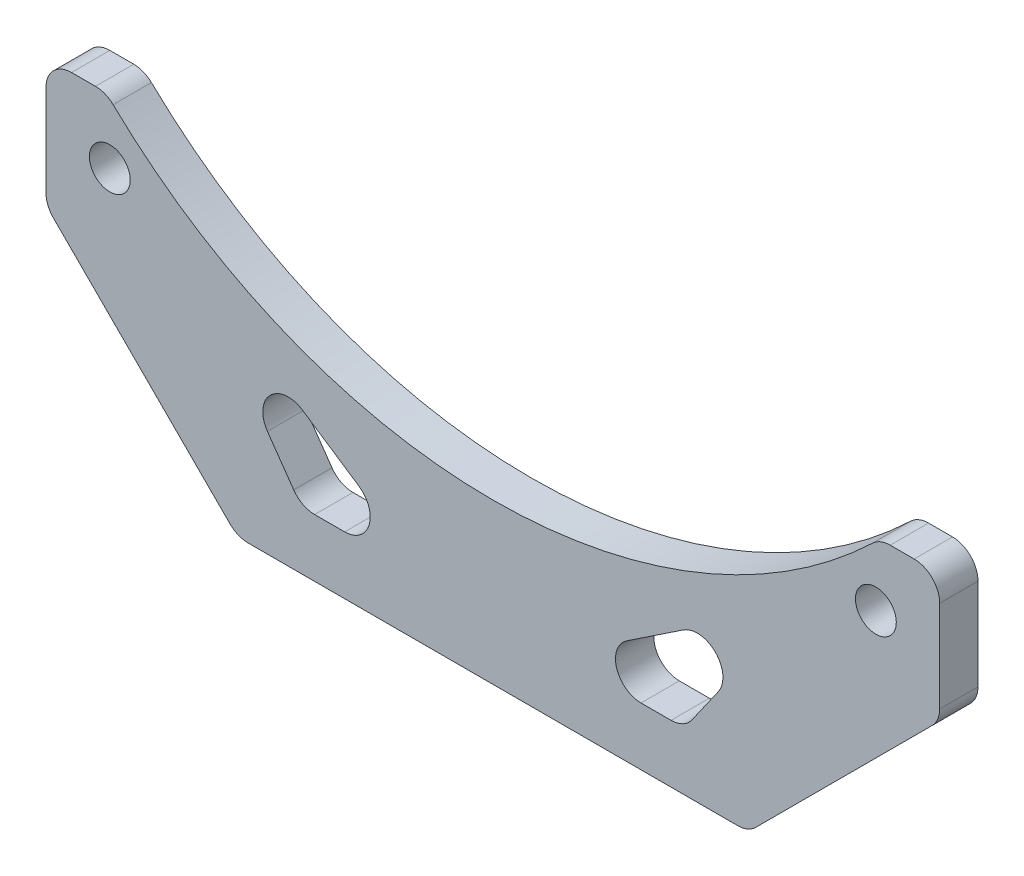
ISO-10303-21;
HEADER;
FILE_DESCRIPTION(('STEP AP214'),'2;1');
FILE_NAME('part.step','',(''),(''),'','','');
FILE_SCHEMA(('AUTOMOTIVE_DESIGN { 1 0 10303 214 1 1 1 1 }'));
ENDSEC;
DATA;
#1=APPLICATION_CONTEXT('core data for automotive mechanical design processes');
#2=APPLICATION_PROTOCOL_DEFINITION('international standard','automotive_design',2000,#1);
#3=PRODUCT_CONTEXT('',#1,'mechanical');
#4=PRODUCT('Part','Part','',(#3));
#5=PRODUCT_RELATED_PRODUCT_CATEGORY('part','',(#4));
#6=PRODUCT_DEFINITION_FORMATION('','',#4);
#7=PRODUCT_DEFINITION_CONTEXT('part definition',#1,'design');
#8=PRODUCT_DEFINITION('design','',#6,#7);
#9=PRODUCT_DEFINITION_SHAPE('','',#8);
#10=(LENGTH_UNIT() NAMED_UNIT(*) SI_UNIT(.MILLI.,.METRE.));
#11=(NAMED_UNIT(*) PLANE_ANGLE_UNIT() SI_UNIT($,.RADIAN.));
#12=(NAMED_UNIT(*) SI_UNIT($,.STERADIAN.) SOLID_ANGLE_UNIT());
#13=UNCERTAINTY_MEASURE_WITH_UNIT(LENGTH_MEASURE(1.E-05),#10,'distance_accuracy_value','');
#14=(GEOMETRIC_REPRESENTATION_CONTEXT(3) GLOBAL_UNCERTAINTY_ASSIGNED_CONTEXT((#13)) GLOBAL_UNIT_ASSIGNED_CONTEXT((#10,
#11,#12)) REPRESENTATION_CONTEXT('',''));
#15=CARTESIAN_POINT('',(0.,0.,0.));
#16=DIRECTION('',(0.,0.,1.));
#17=DIRECTION('',(1.,0.,0.));
#18=AXIS2_PLACEMENT_3D('',#15,#16,#17);
#19=CARTESIAN_POINT('',(30.,35.5000000000022,3.));
#20=DIRECTION('',(0.,0.,1.));
#21=DIRECTION('',(1.,0.,0.));
#22=AXIS2_PLACEMENT_3D('',#19,#20,#21);
#23=PLANE('',#22);
#24=DIRECTION('',(-1.,0.,0.));
#25=VECTOR('',#24,1.);
#26=CARTESIAN_POINT('',(45.0249792013122,5.,3.));
#27=LINE('',#26,#25);
#28=CARTESIAN_POINT('',(63.,5.,3.));
#29=VERTEX_POINT('',#28);
#30=CARTESIAN_POINT('',(61.1247489949716,5.,3.));
#31=VERTEX_POINT('',#30);
#32=EDGE_CURVE('E282',#29,#31,#27,.T.);
#33=ORIENTED_EDGE('',*,*,#32,.T.);
#34=CARTESIAN_POINT('',(61.1247489949716,3.,3.));
#35=DIRECTION('',(0.,0.,1.));
#36=DIRECTION('',(1.,0.,0.));
#37=AXIS2_PLACEMENT_3D('',#34,#35,#36);
#38=CIRCLE('',#37,2.);
#39=CARTESIAN_POINT('',(59.7414268174173,4.44444444444442,3.));
#40=VERTEX_POINT('',#39);
#41=EDGE_CURVE('E359',#31,#40,#38,.T.);
#42=ORIENTED_EDGE('',*,*,#41,.T.);
#43=CARTESIAN_POINT('',(29.9999999999983,35.5000000000004,3.));
#44=DIRECTION('',(0.,0.,1.));
#45=DIRECTION('',(1.,0.,0.));
#46=AXIS2_PLACEMENT_3D('',#43,#44,#45);
#47=CIRCLE('',#46,43.0000000000014);
#48=CARTESIAN_POINT('',(0.258573182579214,4.44444444444443,3.));
#49=VERTEX_POINT('',#48);
#50=EDGE_CURVE('E254',#49,#40,#47,.T.);
#51=ORIENTED_EDGE('',*,*,#50,.F.);
#52=CARTESIAN_POINT('',(-1.12474899497512,3.00000000000001,3.));
#53=DIRECTION('',(0.,0.,1.));
#54=DIRECTION('',(1.,0.,0.));
#55=AXIS2_PLACEMENT_3D('',#52,#53,#54);
#56=CIRCLE('',#55,2.);
#57=CARTESIAN_POINT('',(-1.12474899497512,5.,3.));
#58=VERTEX_POINT('',#57);
#59=EDGE_CURVE('E347',#49,#58,#56,.T.);
#60=ORIENTED_EDGE('',*,*,#59,.T.);
#61=DIRECTION('',(-1.,0.,0.));
#62=VECTOR('',#61,1.);
#63=CARTESIAN_POINT('',(-5.,5.,3.));
#64=LINE('',#63,#62);
#65=CARTESIAN_POINT('',(-3.,5.,3.));
#66=VERTEX_POINT('',#65);
#67=EDGE_CURVE('E285',#58,#66,#64,.T.);
#68=ORIENTED_EDGE('',*,*,#67,.T.);
#69=CARTESIAN_POINT('',(-3.,3.,3.));
#70=DIRECTION('',(0.,0.,1.));
#71=DIRECTION('',(1.,0.,0.));
#72=AXIS2_PLACEMENT_3D('',#69,#70,#71);
#73=CIRCLE('',#72,2.);
#74=CARTESIAN_POINT('',(-5.,3.,3.));
#75=VERTEX_POINT('',#74);
#76=EDGE_CURVE('E345',#66,#75,#73,.T.);
#77=ORIENTED_EDGE('',*,*,#76,.T.);
#78=DIRECTION('',(0.,-1.,0.));
#79=VECTOR('',#78,1.);
#80=CARTESIAN_POINT('',(-5.,5.,3.));
#81=LINE('',#80,#79);
#82=CARTESIAN_POINT('',(-5.,-4.17157287525381,3.));
#83=VERTEX_POINT('',#82);
#84=EDGE_CURVE('E288',#75,#83,#81,.T.);
#85=ORIENTED_EDGE('',*,*,#84,.T.);
#86=CARTESIAN_POINT('',(-3.,-4.17157287525381,3.));
#87=DIRECTION('',(0.,0.,1.));
#88=DIRECTION('',(1.,0.,0.));
#89=AXIS2_PLACEMENT_3D('',#86,#87,#88);
#90=CIRCLE('',#89,2.);
#91=CARTESIAN_POINT('',(-4.4142135623731,-5.58578643762691,3.));
#92=VERTEX_POINT('',#91);
#93=EDGE_CURVE('E349',#83,#92,#90,.T.);
#94=ORIENTED_EDGE('',*,*,#93,.T.);
#95=DIRECTION('',(0.707106781186547,-0.707106781186548,0.));
#96=VECTOR('',#95,1.);
#97=CARTESIAN_POINT('',(-5.,-5.,3.));
#98=LINE('',#97,#96);
#99=CARTESIAN_POINT('',(9.41421356237308,-19.4142135623731,3.));
#100=VERTEX_POINT('',#99);
#101=EDGE_CURVE('E291',#92,#100,#98,.T.);
#102=ORIENTED_EDGE('',*,*,#101,.T.);
#103=CARTESIAN_POINT('',(10.8284271247462,-18.,3.));
#104=DIRECTION('',(0.,0.,1.));
#105=DIRECTION('',(1.,0.,0.));
#106=AXIS2_PLACEMENT_3D('',#103,#104,#105);
#107=CIRCLE('',#106,2.);
#108=CARTESIAN_POINT('',(10.8284271247462,-20.,3.));
#109=VERTEX_POINT('',#108);
#110=EDGE_CURVE('E351',#100,#109,#107,.T.);
#111=ORIENTED_EDGE('',*,*,#110,.T.);
#112=DIRECTION('',(1.,0.,0.));
#113=VECTOR('',#112,1.);
#114=CARTESIAN_POINT('',(9.99999999999999,-20.,3.));
#115=LINE('',#114,#113);
#116=CARTESIAN_POINT('',(49.1715728752538,-20.,3.));
#117=VERTEX_POINT('',#116);
#118=EDGE_CURVE('E294',#109,#117,#115,.T.);
#119=ORIENTED_EDGE('',*,*,#118,.T.);
#120=CARTESIAN_POINT('',(49.1715728752538,-18.,3.));
#121=DIRECTION('',(0.,0.,1.));
#122=DIRECTION('',(1.,0.,0.));
#123=AXIS2_PLACEMENT_3D('',#120,#121,#122);
#124=CIRCLE('',#123,2.);
#125=CARTESIAN_POINT('',(50.5857864376269,-19.4142135623731,3.));
#126=VERTEX_POINT('',#125);
#127=EDGE_CURVE('E353',#117,#126,#124,.T.);
#128=ORIENTED_EDGE('',*,*,#127,.T.);
#129=DIRECTION('',(0.707106781186547,0.707106781186547,0.));
#130=VECTOR('',#129,1.);
#131=CARTESIAN_POINT('',(50.,-20.,3.));
#132=LINE('',#131,#130);
#133=CARTESIAN_POINT('',(64.4142135623731,-5.58578643762691,3.));
#134=VERTEX_POINT('',#133);
#135=EDGE_CURVE('E275',#126,#134,#132,.T.);
#136=ORIENTED_EDGE('',*,*,#135,.T.);
#137=CARTESIAN_POINT('',(63.,-4.17157287525381,3.));
#138=DIRECTION('',(0.,0.,1.));
#139=DIRECTION('',(1.,0.,0.));
#140=AXIS2_PLACEMENT_3D('',#137,#138,#139);
#141=CIRCLE('',#140,2.);
#142=CARTESIAN_POINT('',(65.,-4.17157287525381,3.));
#143=VERTEX_POINT('',#142);
#144=EDGE_CURVE('E355',#134,#143,#141,.T.);
#145=ORIENTED_EDGE('',*,*,#144,.T.);
#146=DIRECTION('',(0.,1.,0.));
#147=VECTOR('',#146,1.);
#148=CARTESIAN_POINT('',(65.,5.,3.));
#149=LINE('',#148,#147);
#150=CARTESIAN_POINT('',(65.,3.,3.));
#151=VERTEX_POINT('',#150);
#152=EDGE_CURVE('E278',#143,#151,#149,.T.);
#153=ORIENTED_EDGE('',*,*,#152,.T.);
#154=CARTESIAN_POINT('',(63.,3.,3.));
#155=DIRECTION('',(0.,0.,1.));
#156=DIRECTION('',(1.,0.,0.));
#157=AXIS2_PLACEMENT_3D('',#154,#155,#156);
#158=CIRCLE('',#157,2.);
#159=EDGE_CURVE('E357',#151,#29,#158,.T.);
#160=ORIENTED_EDGE('',*,*,#159,.T.);
#161=EDGE_LOOP('',(#33,#42,#51,#60,#68,#77,#85,#94,#102,#111,#119,#128,#136,#145,#153,#160));
#162=FACE_BOUND('',#161,.T.);
#163=DIRECTION('',(-0.573576436351044,0.819152044288993,0.));
#164=VECTOR('',#163,1.);
#165=CARTESIAN_POINT('',(15.,-15.464816241512,3.));
#166=LINE('',#165,#164);
#167=CARTESIAN_POINT('',(14.4028300125255,-14.6119691142141,3.));
#168=VERTEX_POINT('',#167);
#169=CARTESIAN_POINT('',(12.3425347261483,-11.6695625076743,3.));
#170=VERTEX_POINT('',#169);
#171=EDGE_CURVE('E268',#168,#170,#166,.T.);
#172=ORIENTED_EDGE('',*,*,#171,.T.);
#173=CARTESIAN_POINT('',(13.9808388147263,-10.5224096349722,3.));
#174=DIRECTION('',(0.,0.,1.));
#175=DIRECTION('',(1.,0.,0.));
#176=AXIS2_PLACEMENT_3D('',#173,#174,#175);
#177=CIRCLE('',#176,2.);
#178=CARTESIAN_POINT('',(15.0902392071767,-8.85830904629649,3.));
#179=VERTEX_POINT('',#178);
#180=EDGE_CURVE('E417',#170,#179,#177,.F.);
#181=ORIENTED_EDGE('',*,*,#180,.T.);
#182=DIRECTION('',(0.832050294337844,-0.554700196225229,0.));
#183=VECTOR('',#182,1.);
#184=CARTESIAN_POINT('',(6.2451345610044,-2.96157261551494,3.));
#185=LINE('',#184,#183);
#186=CARTESIAN_POINT('',(19.5038491169865,-11.8007156528363,3.));
#187=VERTEX_POINT('',#186);
#188=EDGE_CURVE('E447',#179,#187,#185,.T.);
#189=ORIENTED_EDGE('',*,*,#188,.T.);
#190=CARTESIAN_POINT('',(18.394448724536,-13.464816241512,3.));
#191=DIRECTION('',(0.,0.,1.));
#192=DIRECTION('',(1.,0.,0.));
#193=AXIS2_PLACEMENT_3D('',#190,#191,#192);
#194=CIRCLE('',#193,2.);
#195=CARTESIAN_POINT('',(18.394448724536,-15.464816241512,3.));
#196=VERTEX_POINT('',#195);
#197=EDGE_CURVE('E11',#187,#196,#194,.F.);
#198=ORIENTED_EDGE('',*,*,#197,.T.);
#199=DIRECTION('',(-1.,0.,0.));
#200=VECTOR('',#199,1.);
#201=CARTESIAN_POINT('',(25.,-15.464816241512,3.));
#202=LINE('',#201,#200);
#203=CARTESIAN_POINT('',(16.0411341011035,-15.464816241512,3.));
#204=VERTEX_POINT('',#203);
#205=EDGE_CURVE('E445',#196,#204,#202,.T.);
#206=ORIENTED_EDGE('',*,*,#205,.T.);
#207=CARTESIAN_POINT('',(16.0411341011035,-13.464816241512,3.));
#208=DIRECTION('',(0.,0.,1.));
#209=DIRECTION('',(1.,0.,0.));
#210=AXIS2_PLACEMENT_3D('',#207,#208,#209);
#211=CIRCLE('',#210,2.);
#212=EDGE_CURVE('E421',#204,#168,#211,.F.);
#213=ORIENTED_EDGE('',*,*,#212,.T.);
#214=EDGE_LOOP('',(#172,#181,#189,#198,#206,#213));
#215=FACE_BOUND('',#214,.T.);
#216=DIRECTION('',(0.832050294337844,0.554700196225229,0.));
#217=VECTOR('',#216,1.);
#218=CARTESIAN_POINT('',(53.7548654389956,-2.96157261551494,3.));
#219=LINE('',#218,#217);
#220=CARTESIAN_POINT('',(40.4961508830135,-11.8007156528363,3.));
#221=VERTEX_POINT('',#220);
#222=CARTESIAN_POINT('',(44.9097607928233,-8.85830904629648,3.));
#223=VERTEX_POINT('',#222);
#224=EDGE_CURVE('E257',#221,#223,#219,.T.);
#225=ORIENTED_EDGE('',*,*,#224,.T.);
#226=CARTESIAN_POINT('',(46.0191611852737,-10.5224096349722,3.));
#227=DIRECTION('',(0.,0.,1.));
#228=DIRECTION('',(1.,0.,0.));
#229=AXIS2_PLACEMENT_3D('',#226,#227,#228);
#230=CIRCLE('',#229,2.);
#231=CARTESIAN_POINT('',(47.6574652738517,-11.6695625076743,3.));
#232=VERTEX_POINT('',#231);
#233=EDGE_CURVE('E230',#223,#232,#230,.F.);
#234=ORIENTED_EDGE('',*,*,#233,.T.);
#235=DIRECTION('',(-0.573576436351044,-0.819152044288993,0.));
#236=VECTOR('',#235,1.);
#237=CARTESIAN_POINT('',(45.,-15.464816241512,3.));
#238=LINE('',#237,#236);
#239=CARTESIAN_POINT('',(45.5971699874745,-14.6119691142141,3.));
#240=VERTEX_POINT('',#239);
#241=EDGE_CURVE('E240',#232,#240,#238,.T.);
#242=ORIENTED_EDGE('',*,*,#241,.T.);
#243=CARTESIAN_POINT('',(43.9588658988965,-13.464816241512,3.));
#244=DIRECTION('',(0.,0.,1.));
#245=DIRECTION('',(1.,0.,0.));
#246=AXIS2_PLACEMENT_3D('',#243,#244,#245);
#247=CIRCLE('',#246,2.);
#248=CARTESIAN_POINT('',(43.9588658988965,-15.464816241512,3.));
#249=VERTEX_POINT('',#248);
#250=EDGE_CURVE('E413',#240,#249,#247,.F.);
#251=ORIENTED_EDGE('',*,*,#250,.T.);
#252=DIRECTION('',(-1.,0.,0.));
#253=VECTOR('',#252,1.);
#254=CARTESIAN_POINT('',(35.,-15.464816241512,3.));
#255=LINE('',#254,#253);
#256=CARTESIAN_POINT('',(41.605551275464,-15.464816241512,3.));
#257=VERTEX_POINT('',#256);
#258=EDGE_CURVE('E459',#249,#257,#255,.T.);
#259=ORIENTED_EDGE('',*,*,#258,.T.);
#260=CARTESIAN_POINT('',(41.605551275464,-13.464816241512,3.));
#261=DIRECTION('',(0.,0.,1.));
#262=DIRECTION('',(1.,0.,0.));
#263=AXIS2_PLACEMENT_3D('',#260,#261,#262);
#264=CIRCLE('',#263,2.);
#265=EDGE_CURVE('E410',#257,#221,#264,.F.);
#266=ORIENTED_EDGE('',*,*,#265,.T.);
#267=EDGE_LOOP('',(#225,#234,#242,#251,#259,#266));
#268=FACE_BOUND('',#267,.T.);
#269=CARTESIAN_POINT('',(60.,0.,3.));
#270=DIRECTION('',(0.,0.,1.));
#271=DIRECTION('',(1.,0.,0.));
#272=AXIS2_PLACEMENT_3D('',#269,#270,#271);
#273=CIRCLE('',#272,1.6);
#274=CARTESIAN_POINT('',(61.6,0.,3.));
#275=VERTEX_POINT('',#274);
#276=EDGE_CURVE('E269',#275,#275,#273,.T.);
#277=ORIENTED_EDGE('',*,*,#276,.F.);
#278=EDGE_LOOP('',(#277));
#279=FACE_BOUND('',#278,.T.);
#280=CARTESIAN_POINT('',(0.,0.,3.));
#281=DIRECTION('',(0.,0.,1.));
#282=DIRECTION('',(1.,0.,0.));
#283=AXIS2_PLACEMENT_3D('',#280,#281,#282);
#284=CIRCLE('',#283,1.6);
#285=CARTESIAN_POINT('',(1.6,0.,3.));
#286=VERTEX_POINT('',#285);
#287=EDGE_CURVE('E261',#286,#286,#284,.T.);
#288=ORIENTED_EDGE('',*,*,#287,.F.);
#289=EDGE_LOOP('',(#288));
#290=FACE_BOUND('',#289,.T.);
#291=ADVANCED_FACE('F34',(#162,#215,#268,#279,#290),#23,.T.);
#292=CARTESIAN_POINT('',(30.,35.5000000000022,0.));
#293=DIRECTION('',(0.,0.,1.));
#294=DIRECTION('',(1.,0.,0.));
#295=AXIS2_PLACEMENT_3D('',#292,#293,#294);
#296=PLANE('',#295);
#297=DIRECTION('',(-1.,0.,0.));
#298=VECTOR('',#297,1.);
#299=CARTESIAN_POINT('',(25.,-15.464816241512,0.));
#300=LINE('',#299,#298);
#301=CARTESIAN_POINT('',(18.394448724536,-15.464816241512,0.));
#302=VERTEX_POINT('',#301);
#303=CARTESIAN_POINT('',(16.0411341011035,-15.464816241512,0.));
#304=VERTEX_POINT('',#303);
#305=EDGE_CURVE('E428',#302,#304,#300,.T.);
#306=ORIENTED_EDGE('',*,*,#305,.F.);
#307=CARTESIAN_POINT('',(18.394448724536,-13.464816241512,0.));
#308=DIRECTION('',(0.,0.,1.));
#309=DIRECTION('',(1.,0.,0.));
#310=AXIS2_PLACEMENT_3D('',#307,#308,#309);
#311=CIRCLE('',#310,2.);
#312=CARTESIAN_POINT('',(19.5038491169865,-11.8007156528363,0.));
#313=VERTEX_POINT('',#312);
#314=EDGE_CURVE('E42',#302,#313,#311,.T.);
#315=ORIENTED_EDGE('',*,*,#314,.T.);
#316=DIRECTION('',(0.832050294337844,-0.554700196225229,0.));
#317=VECTOR('',#316,1.);
#318=CARTESIAN_POINT('',(6.2451345610044,-2.96157261551494,0.));
#319=LINE('',#318,#317);
#320=CARTESIAN_POINT('',(15.0902392071767,-8.85830904629649,0.));
#321=VERTEX_POINT('',#320);
#322=EDGE_CURVE('E426',#321,#313,#319,.T.);
#323=ORIENTED_EDGE('',*,*,#322,.F.);
#324=CARTESIAN_POINT('',(13.9808388147263,-10.5224096349722,0.));
#325=DIRECTION('',(0.,0.,1.));
#326=DIRECTION('',(1.,0.,0.));
#327=AXIS2_PLACEMENT_3D('',#324,#325,#326);
#328=CIRCLE('',#327,2.);
#329=CARTESIAN_POINT('',(12.3425347261483,-11.6695625076743,0.));
#330=VERTEX_POINT('',#329);
#331=EDGE_CURVE('E415',#321,#330,#328,.T.);
#332=ORIENTED_EDGE('',*,*,#331,.T.);
#333=DIRECTION('',(-0.573576436351044,0.819152044288993,0.));
#334=VECTOR('',#333,1.);
#335=CARTESIAN_POINT('',(15.,-15.464816241512,0.));
#336=LINE('',#335,#334);
#337=CARTESIAN_POINT('',(14.4028300125255,-14.6119691142141,0.));
#338=VERTEX_POINT('',#337);
#339=EDGE_CURVE('E453',#338,#330,#336,.T.);
#340=ORIENTED_EDGE('',*,*,#339,.F.);
#341=CARTESIAN_POINT('',(16.0411341011035,-13.464816241512,0.));
#342=DIRECTION('',(0.,0.,1.));
#343=DIRECTION('',(1.,0.,0.));
#344=AXIS2_PLACEMENT_3D('',#341,#342,#343);
#345=CIRCLE('',#344,2.);
#346=EDGE_CURVE('E419',#338,#304,#345,.T.);
#347=ORIENTED_EDGE('',*,*,#346,.T.);
#348=EDGE_LOOP('',(#306,#315,#323,#332,#340,#347));
#349=FACE_BOUND('',#348,.T.);
#350=DIRECTION('',(-1.,0.,0.));
#351=VECTOR('',#350,1.);
#352=CARTESIAN_POINT('',(35.,-15.464816241512,0.));
#353=LINE('',#352,#351);
#354=CARTESIAN_POINT('',(43.9588658988965,-15.464816241512,0.));
#355=VERTEX_POINT('',#354);
#356=CARTESIAN_POINT('',(41.605551275464,-15.464816241512,0.));
#357=VERTEX_POINT('',#356);
#358=EDGE_CURVE('E247',#355,#357,#353,.T.);
#359=ORIENTED_EDGE('',*,*,#358,.F.);
#360=CARTESIAN_POINT('',(43.9588658988965,-13.464816241512,0.));
#361=DIRECTION('',(0.,0.,1.));
#362=DIRECTION('',(1.,0.,0.));
#363=AXIS2_PLACEMENT_3D('',#360,#361,#362);
#364=CIRCLE('',#363,2.);
#365=CARTESIAN_POINT('',(45.5971699874745,-14.6119691142141,0.));
#366=VERTEX_POINT('',#365);
#367=EDGE_CURVE('E246',#355,#366,#364,.T.);
#368=ORIENTED_EDGE('',*,*,#367,.T.);
#369=DIRECTION('',(-0.573576436351044,-0.819152044288993,0.));
#370=VECTOR('',#369,1.);
#371=CARTESIAN_POINT('',(45.,-15.464816241512,0.));
#372=LINE('',#371,#370);
#373=CARTESIAN_POINT('',(47.6574652738517,-11.6695625076743,0.));
#374=VERTEX_POINT('',#373);
#375=EDGE_CURVE('E237',#374,#366,#372,.T.);
#376=ORIENTED_EDGE('',*,*,#375,.F.);
#377=CARTESIAN_POINT('',(46.0191611852737,-10.5224096349722,0.));
#378=DIRECTION('',(0.,0.,1.));
#379=DIRECTION('',(1.,0.,0.));
#380=AXIS2_PLACEMENT_3D('',#377,#378,#379);
#381=CIRCLE('',#380,2.);
#382=CARTESIAN_POINT('',(44.9097607928233,-8.85830904629648,0.));
#383=VERTEX_POINT('',#382);
#384=EDGE_CURVE('E220',#374,#383,#381,.T.);
#385=ORIENTED_EDGE('',*,*,#384,.T.);
#386=DIRECTION('',(0.832050294337844,0.554700196225229,0.));
#387=VECTOR('',#386,1.);
#388=CARTESIAN_POINT('',(53.7548654389956,-2.96157261551494,0.));
#389=LINE('',#388,#387);
#390=CARTESIAN_POINT('',(40.4961508830135,-11.8007156528363,0.));
#391=VERTEX_POINT('',#390);
#392=EDGE_CURVE('E251',#391,#383,#389,.T.);
#393=ORIENTED_EDGE('',*,*,#392,.F.);
#394=CARTESIAN_POINT('',(41.605551275464,-13.464816241512,0.));
#395=DIRECTION('',(0.,0.,1.));
#396=DIRECTION('',(1.,0.,0.));
#397=AXIS2_PLACEMENT_3D('',#394,#395,#396);
#398=CIRCLE('',#397,2.);
#399=EDGE_CURVE('E408',#391,#357,#398,.T.);
#400=ORIENTED_EDGE('',*,*,#399,.T.);
#401=EDGE_LOOP('',(#359,#368,#376,#385,#393,#400));
#402=FACE_BOUND('',#401,.T.);
#403=CARTESIAN_POINT('',(29.9999999999983,35.5000000000004,0.));
#404=DIRECTION('',(0.,0.,1.));
#405=DIRECTION('',(1.,0.,0.));
#406=AXIS2_PLACEMENT_3D('',#403,#404,#405);
#407=CIRCLE('',#406,43.0000000000014);
#408=CARTESIAN_POINT('',(0.258573182579214,4.44444444444443,0.));
#409=VERTEX_POINT('',#408);
#410=CARTESIAN_POINT('',(59.7414268174173,4.44444444444442,0.));
#411=VERTEX_POINT('',#410);
#412=EDGE_CURVE('E248',#409,#411,#407,.T.);
#413=ORIENTED_EDGE('',*,*,#412,.T.);
#414=CARTESIAN_POINT('',(61.1247489949716,3.,0.));
#415=DIRECTION('',(0.,0.,1.));
#416=DIRECTION('',(1.,0.,0.));
#417=AXIS2_PLACEMENT_3D('',#414,#415,#416);
#418=CIRCLE('',#417,2.);
#419=CARTESIAN_POINT('',(61.1247489949716,5.,0.));
#420=VERTEX_POINT('',#419);
#421=EDGE_CURVE('E377',#411,#420,#418,.F.);
#422=ORIENTED_EDGE('',*,*,#421,.T.);
#423=DIRECTION('',(-1.,0.,0.));
#424=VECTOR('',#423,1.);
#425=CARTESIAN_POINT('',(45.0249792013122,5.,0.));
#426=LINE('',#425,#424);
#427=CARTESIAN_POINT('',(63.,5.,0.));
#428=VERTEX_POINT('',#427);
#429=EDGE_CURVE('E302',#428,#420,#426,.T.);
#430=ORIENTED_EDGE('',*,*,#429,.F.);
#431=CARTESIAN_POINT('',(63.,3.,0.));
#432=DIRECTION('',(0.,0.,1.));
#433=DIRECTION('',(1.,0.,0.));
#434=AXIS2_PLACEMENT_3D('',#431,#432,#433);
#435=CIRCLE('',#434,2.);
#436=CARTESIAN_POINT('',(65.,3.,0.));
#437=VERTEX_POINT('',#436);
#438=EDGE_CURVE('E375',#428,#437,#435,.F.);
#439=ORIENTED_EDGE('',*,*,#438,.T.);
#440=DIRECTION('',(0.,1.,0.));
#441=VECTOR('',#440,1.);
#442=CARTESIAN_POINT('',(65.,5.,0.));
#443=LINE('',#442,#441);
#444=CARTESIAN_POINT('',(65.,-4.17157287525381,0.));
#445=VERTEX_POINT('',#444);
#446=EDGE_CURVE('E299',#445,#437,#443,.T.);
#447=ORIENTED_EDGE('',*,*,#446,.F.);
#448=CARTESIAN_POINT('',(63.,-4.17157287525381,0.));
#449=DIRECTION('',(0.,0.,1.));
#450=DIRECTION('',(1.,0.,0.));
#451=AXIS2_PLACEMENT_3D('',#448,#449,#450);
#452=CIRCLE('',#451,2.);
#453=CARTESIAN_POINT('',(64.4142135623731,-5.58578643762691,0.));
#454=VERTEX_POINT('',#453);
#455=EDGE_CURVE('E373',#445,#454,#452,.F.);
#456=ORIENTED_EDGE('',*,*,#455,.T.);
#457=DIRECTION('',(0.707106781186547,0.707106781186547,0.));
#458=VECTOR('',#457,1.);
#459=CARTESIAN_POINT('',(50.,-20.,0.));
#460=LINE('',#459,#458);
#461=CARTESIAN_POINT('',(50.5857864376269,-19.4142135623731,0.));
#462=VERTEX_POINT('',#461);
#463=EDGE_CURVE('E272',#462,#454,#460,.T.);
#464=ORIENTED_EDGE('',*,*,#463,.F.);
#465=CARTESIAN_POINT('',(49.1715728752538,-18.,0.));
#466=DIRECTION('',(0.,0.,1.));
#467=DIRECTION('',(1.,0.,0.));
#468=AXIS2_PLACEMENT_3D('',#465,#466,#467);
#469=CIRCLE('',#468,2.);
#470=CARTESIAN_POINT('',(49.1715728752538,-20.,0.));
#471=VERTEX_POINT('',#470);
#472=EDGE_CURVE('E371',#462,#471,#469,.F.);
#473=ORIENTED_EDGE('',*,*,#472,.T.);
#474=DIRECTION('',(1.,0.,0.));
#475=VECTOR('',#474,1.);
#476=CARTESIAN_POINT('',(9.99999999999999,-20.,0.));
#477=LINE('',#476,#475);
#478=CARTESIAN_POINT('',(10.8284271247462,-20.,0.));
#479=VERTEX_POINT('',#478);
#480=EDGE_CURVE('E279',#479,#471,#477,.T.);
#481=ORIENTED_EDGE('',*,*,#480,.F.);
#482=CARTESIAN_POINT('',(10.8284271247462,-18.,0.));
#483=DIRECTION('',(0.,0.,1.));
#484=DIRECTION('',(1.,0.,0.));
#485=AXIS2_PLACEMENT_3D('',#482,#483,#484);
#486=CIRCLE('',#485,2.);
#487=CARTESIAN_POINT('',(9.41421356237308,-19.4142135623731,0.));
#488=VERTEX_POINT('',#487);
#489=EDGE_CURVE('E369',#479,#488,#486,.F.);
#490=ORIENTED_EDGE('',*,*,#489,.T.);
#491=DIRECTION('',(0.707106781186547,-0.707106781186548,0.));
#492=VECTOR('',#491,1.);
#493=CARTESIAN_POINT('',(-5.,-5.,0.));
#494=LINE('',#493,#492);
#495=CARTESIAN_POINT('',(-4.4142135623731,-5.58578643762691,0.));
#496=VERTEX_POINT('',#495);
#497=EDGE_CURVE('E310',#496,#488,#494,.T.);
#498=ORIENTED_EDGE('',*,*,#497,.F.);
#499=CARTESIAN_POINT('',(-3.,-4.17157287525381,0.));
#500=DIRECTION('',(0.,0.,1.));
#501=DIRECTION('',(1.,0.,0.));
#502=AXIS2_PLACEMENT_3D('',#499,#500,#501);
#503=CIRCLE('',#502,2.);
#504=CARTESIAN_POINT('',(-5.,-4.17157287525381,0.));
#505=VERTEX_POINT('',#504);
#506=EDGE_CURVE('E49',#496,#505,#503,.F.);
#507=ORIENTED_EDGE('',*,*,#506,.T.);
#508=DIRECTION('',(0.,-1.,0.));
#509=VECTOR('',#508,1.);
#510=CARTESIAN_POINT('',(-5.,5.,0.));
#511=LINE('',#510,#509);
#512=CARTESIAN_POINT('',(-5.,3.,0.));
#513=VERTEX_POINT('',#512);
#514=EDGE_CURVE('E308',#513,#505,#511,.T.);
#515=ORIENTED_EDGE('',*,*,#514,.F.);
#516=CARTESIAN_POINT('',(-3.,3.,0.));
#517=DIRECTION('',(0.,0.,1.));
#518=DIRECTION('',(1.,0.,0.));
#519=AXIS2_PLACEMENT_3D('',#516,#517,#518);
#520=CIRCLE('',#519,2.);
#521=CARTESIAN_POINT('',(-3.,5.,0.));
#522=VERTEX_POINT('',#521);
#523=EDGE_CURVE('E57',#513,#522,#520,.F.);
#524=ORIENTED_EDGE('',*,*,#523,.T.);
#525=DIRECTION('',(-1.,0.,0.));
#526=VECTOR('',#525,1.);
#527=CARTESIAN_POINT('',(-5.,5.,0.));
#528=LINE('',#527,#526);
#529=CARTESIAN_POINT('',(-1.12474899497512,5.,0.));
#530=VERTEX_POINT('',#529);
#531=EDGE_CURVE('E305',#530,#522,#528,.T.);
#532=ORIENTED_EDGE('',*,*,#531,.F.);
#533=CARTESIAN_POINT('',(-1.12474899497512,3.00000000000001,0.));
#534=DIRECTION('',(0.,0.,1.));
#535=DIRECTION('',(1.,0.,0.));
#536=AXIS2_PLACEMENT_3D('',#533,#534,#535);
#537=CIRCLE('',#536,2.);
#538=EDGE_CURVE('E366',#530,#409,#537,.F.);
#539=ORIENTED_EDGE('',*,*,#538,.T.);
#540=EDGE_LOOP('',(#413,#422,#430,#439,#447,#456,#464,#473,#481,#490,#498,#507,#515,#524,#532,#539));
#541=FACE_BOUND('',#540,.T.);
#542=CARTESIAN_POINT('',(60.,0.,0.));
#543=DIRECTION('',(0.,0.,1.));
#544=DIRECTION('',(1.,0.,0.));
#545=AXIS2_PLACEMENT_3D('',#542,#543,#544);
#546=CIRCLE('',#545,1.6);
#547=CARTESIAN_POINT('',(61.6,0.,0.));
#548=VERTEX_POINT('',#547);
#549=EDGE_CURVE('E264',#548,#548,#546,.T.);
#550=ORIENTED_EDGE('',*,*,#549,.T.);
#551=EDGE_LOOP('',(#550));
#552=FACE_BOUND('',#551,.T.);
#553=CARTESIAN_POINT('',(0.,0.,0.));
#554=DIRECTION('',(0.,0.,1.));
#555=DIRECTION('',(1.,0.,0.));
#556=AXIS2_PLACEMENT_3D('',#553,#554,#555);
#557=CIRCLE('',#556,1.6);
#558=CARTESIAN_POINT('',(1.6,0.,0.));
#559=VERTEX_POINT('',#558);
#560=EDGE_CURVE('E265',#559,#559,#557,.T.);
#561=ORIENTED_EDGE('',*,*,#560,.T.);
#562=EDGE_LOOP('',(#561));
#563=FACE_BOUND('',#562,.T.);
#564=ADVANCED_FACE('F245',(#349,#402,#541,#552,#563),#296,.F.);
#565=CARTESIAN_POINT('',(50.,-20.,3.));
#566=DIRECTION('',(-0.707106781186548,0.707106781186548,0.));
#567=DIRECTION('',(-0.707106781186548,-0.707106781186548,0.));
#568=AXIS2_PLACEMENT_3D('',#565,#566,#567);
#569=PLANE('',#568);
#570=ORIENTED_EDGE('',*,*,#463,.T.);
#571=DIRECTION('',(0.,0.,-1.));
#572=VECTOR('',#571,1.);
#573=CARTESIAN_POINT('',(64.4142135623731,-5.58578643762691,3.));
#574=LINE('',#573,#572);
#575=EDGE_CURVE('E387',#454,#134,#574,.F.);
#576=ORIENTED_EDGE('',*,*,#575,.T.);
#577=ORIENTED_EDGE('',*,*,#135,.F.);
#578=DIRECTION('',(0.,0.,-1.));
#579=VECTOR('',#578,1.);
#580=CARTESIAN_POINT('',(50.5857864376269,-19.4142135623731,3.));
#581=LINE('',#580,#579);
#582=EDGE_CURVE('E384',#126,#462,#581,.T.);
#583=ORIENTED_EDGE('',*,*,#582,.T.);
#584=EDGE_LOOP('',(#570,#576,#577,#583));
#585=FACE_BOUND('',#584,.T.);
#586=ADVANCED_FACE('F495',(#585),#569,.F.);
#587=CARTESIAN_POINT('',(65.,5.,3.));
#588=DIRECTION('',(-1.,0.,0.));
#589=DIRECTION('',(0.,0.,1.));
#590=AXIS2_PLACEMENT_3D('',#587,#588,#589);
#591=PLANE('',#590);
#592=ORIENTED_EDGE('',*,*,#446,.T.);
#593=DIRECTION('',(0.,0.,-1.));
#594=VECTOR('',#593,1.);
#595=CARTESIAN_POINT('',(65.,3.,3.));
#596=LINE('',#595,#594);
#597=EDGE_CURVE('E382',#437,#151,#596,.F.);
#598=ORIENTED_EDGE('',*,*,#597,.T.);
#599=ORIENTED_EDGE('',*,*,#152,.F.);
#600=DIRECTION('',(0.,0.,-1.));
#601=VECTOR('',#600,1.);
#602=CARTESIAN_POINT('',(65.,-4.17157287525381,3.));
#603=LINE('',#602,#601);
#604=EDGE_CURVE('E379',#143,#445,#603,.T.);
#605=ORIENTED_EDGE('',*,*,#604,.T.);
#606=EDGE_LOOP('',(#592,#598,#599,#605));
#607=FACE_BOUND('',#606,.T.);
#608=ADVANCED_FACE('F520',(#607),#591,.F.);
#609=CARTESIAN_POINT('',(45.0249792013122,5.,3.));
#610=DIRECTION('',(0.,-1.,0.));
#611=DIRECTION('',(1.,0.,0.));
#612=AXIS2_PLACEMENT_3D('',#609,#610,#611);
#613=PLANE('',#612);
#614=ORIENTED_EDGE('',*,*,#429,.T.);
#615=DIRECTION('',(0.,0.,1.));
#616=VECTOR('',#615,1.);
#617=CARTESIAN_POINT('',(61.1247489949716,5.,3.));
#618=LINE('',#617,#616);
#619=EDGE_CURVE('E342',#420,#31,#618,.T.);
#620=ORIENTED_EDGE('',*,*,#619,.T.);
#621=ORIENTED_EDGE('',*,*,#32,.F.);
#622=DIRECTION('',(0.,0.,-1.));
#623=VECTOR('',#622,1.);
#624=CARTESIAN_POINT('',(63.,5.,3.));
#625=LINE('',#624,#623);
#626=EDGE_CURVE('E339',#29,#428,#625,.T.);
#627=ORIENTED_EDGE('',*,*,#626,.T.);
#628=EDGE_LOOP('',(#614,#620,#621,#627));
#629=FACE_BOUND('',#628,.T.);
#630=ADVANCED_FACE('F516',(#629),#613,.F.);
#631=CARTESIAN_POINT('',(-5.,5.,3.));
#632=DIRECTION('',(0.,-1.,0.));
#633=DIRECTION('',(1.,0.,0.));
#634=AXIS2_PLACEMENT_3D('',#631,#632,#633);
#635=PLANE('',#634);
#636=ORIENTED_EDGE('',*,*,#67,.F.);
#637=DIRECTION('',(0.,0.,1.));
#638=VECTOR('',#637,1.);
#639=CARTESIAN_POINT('',(-1.12474899497512,5.,3.));
#640=LINE('',#639,#638);
#641=EDGE_CURVE('E231',#58,#530,#640,.F.);
#642=ORIENTED_EDGE('',*,*,#641,.T.);
#643=ORIENTED_EDGE('',*,*,#531,.T.);
#644=DIRECTION('',(0.,0.,-1.));
#645=VECTOR('',#644,1.);
#646=CARTESIAN_POINT('',(-3.,5.,3.));
#647=LINE('',#646,#645);
#648=EDGE_CURVE('E403',#522,#66,#647,.F.);
#649=ORIENTED_EDGE('',*,*,#648,.T.);
#650=EDGE_LOOP('',(#636,#642,#643,#649));
#651=FACE_BOUND('',#650,.T.);
#652=ADVANCED_FACE('F512',(#651),#635,.F.);
#653=CARTESIAN_POINT('',(-5.,5.,3.));
#654=DIRECTION('',(1.,0.,0.));
#655=DIRECTION('',(0.,1.,0.));
#656=AXIS2_PLACEMENT_3D('',#653,#654,#655);
#657=PLANE('',#656);
#658=ORIENTED_EDGE('',*,*,#514,.T.);
#659=DIRECTION('',(0.,0.,-1.));
#660=VECTOR('',#659,1.);
#661=CARTESIAN_POINT('',(-5.,-4.17157287525381,3.));
#662=LINE('',#661,#660);
#663=EDGE_CURVE('E401',#505,#83,#662,.F.);
#664=ORIENTED_EDGE('',*,*,#663,.T.);
#665=ORIENTED_EDGE('',*,*,#84,.F.);
#666=DIRECTION('',(0.,0.,-1.));
#667=VECTOR('',#666,1.);
#668=CARTESIAN_POINT('',(-5.,3.,3.));
#669=LINE('',#668,#667);
#670=EDGE_CURVE('E399',#75,#513,#669,.T.);
#671=ORIENTED_EDGE('',*,*,#670,.T.);
#672=EDGE_LOOP('',(#658,#664,#665,#671));
#673=FACE_BOUND('',#672,.T.);
#674=ADVANCED_FACE('F508',(#673),#657,.F.);
#675=CARTESIAN_POINT('',(-5.,-5.,3.));
#676=DIRECTION('',(0.707106781186548,0.707106781186547,0.));
#677=DIRECTION('',(-0.707106781186547,0.707106781186548,0.));
#678=AXIS2_PLACEMENT_3D('',#675,#676,#677);
#679=PLANE('',#678);
#680=ORIENTED_EDGE('',*,*,#497,.T.);
#681=DIRECTION('',(0.,0.,-1.));
#682=VECTOR('',#681,1.);
#683=CARTESIAN_POINT('',(9.41421356237309,-19.4142135623731,3.));
#684=LINE('',#683,#682);
#685=EDGE_CURVE('E397',#488,#100,#684,.F.);
#686=ORIENTED_EDGE('',*,*,#685,.T.);
#687=ORIENTED_EDGE('',*,*,#101,.F.);
#688=DIRECTION('',(0.,0.,-1.));
#689=VECTOR('',#688,1.);
#690=CARTESIAN_POINT('',(-4.4142135623731,-5.58578643762691,3.));
#691=LINE('',#690,#689);
#692=EDGE_CURVE('E394',#92,#496,#691,.T.);
#693=ORIENTED_EDGE('',*,*,#692,.T.);
#694=EDGE_LOOP('',(#680,#686,#687,#693));
#695=FACE_BOUND('',#694,.T.);
#696=ADVANCED_FACE('F504',(#695),#679,.F.);
#697=CARTESIAN_POINT('',(9.99999999999999,-20.,3.));
#698=DIRECTION('',(0.,1.,0.));
#699=DIRECTION('',(0.,0.,1.));
#700=AXIS2_PLACEMENT_3D('',#697,#698,#699);
#701=PLANE('',#700);
#702=ORIENTED_EDGE('',*,*,#480,.T.);
#703=DIRECTION('',(0.,0.,-1.));
#704=VECTOR('',#703,1.);
#705=CARTESIAN_POINT('',(49.1715728752538,-20.,3.));
#706=LINE('',#705,#704);
#707=EDGE_CURVE('E392',#471,#117,#706,.F.);
#708=ORIENTED_EDGE('',*,*,#707,.T.);
#709=ORIENTED_EDGE('',*,*,#118,.F.);
#710=DIRECTION('',(0.,0.,-1.));
#711=VECTOR('',#710,1.);
#712=CARTESIAN_POINT('',(10.8284271247462,-20.,3.));
#713=LINE('',#712,#711);
#714=EDGE_CURVE('E389',#109,#479,#713,.T.);
#715=ORIENTED_EDGE('',*,*,#714,.T.);
#716=EDGE_LOOP('',(#702,#708,#709,#715));
#717=FACE_BOUND('',#716,.T.);
#718=ADVANCED_FACE('F501',(#717),#701,.F.);
#719=CARTESIAN_POINT('',(60.,0.,3.));
#720=DIRECTION('',(0.,0.,-1.));
#721=DIRECTION('',(-1.,0.,0.));
#722=AXIS2_PLACEMENT_3D('',#719,#720,#721);
#723=CYLINDRICAL_SURFACE('',#722,1.6);
#724=ORIENTED_EDGE('',*,*,#276,.T.);
#725=EDGE_LOOP('',(#724));
#726=FACE_BOUND('',#725,.T.);
#727=ORIENTED_EDGE('',*,*,#549,.F.);
#728=EDGE_LOOP('',(#727));
#729=FACE_BOUND('',#728,.T.);
#730=ADVANCED_FACE('F498',(#726,#729),#723,.F.);
#731=CARTESIAN_POINT('',(0.,0.,3.));
#732=DIRECTION('',(0.,0.,-1.));
#733=DIRECTION('',(-1.,0.,0.));
#734=AXIS2_PLACEMENT_3D('',#731,#732,#733);
#735=CYLINDRICAL_SURFACE('',#734,1.6);
#736=ORIENTED_EDGE('',*,*,#287,.T.);
#737=EDGE_LOOP('',(#736));
#738=FACE_BOUND('',#737,.T.);
#739=ORIENTED_EDGE('',*,*,#560,.F.);
#740=EDGE_LOOP('',(#739));
#741=FACE_BOUND('',#740,.T.);
#742=ADVANCED_FACE('F552',(#738,#741),#735,.F.);
#743=CARTESIAN_POINT('',(45.,-15.464816241512,3.));
#744=DIRECTION('',(0.819152044288993,-0.573576436351044,0.));
#745=DIRECTION('',(0.573576436351044,0.819152044288993,0.));
#746=AXIS2_PLACEMENT_3D('',#743,#744,#745);
#747=PLANE('',#746);
#748=ORIENTED_EDGE('',*,*,#241,.F.);
#749=DIRECTION('',(0.,0.,-1.));
#750=VECTOR('',#749,1.);
#751=CARTESIAN_POINT('',(47.6574652738517,-11.6695625076743,0.));
#752=LINE('',#751,#750);
#753=EDGE_CURVE('E224',#232,#374,#752,.T.);
#754=ORIENTED_EDGE('',*,*,#753,.T.);
#755=ORIENTED_EDGE('',*,*,#375,.T.);
#756=DIRECTION('',(0.,0.,-1.));
#757=VECTOR('',#756,1.);
#758=CARTESIAN_POINT('',(45.5971699874745,-14.6119691142141,3.));
#759=LINE('',#758,#757);
#760=EDGE_CURVE('E242',#366,#240,#759,.F.);
#761=ORIENTED_EDGE('',*,*,#760,.T.);
#762=EDGE_LOOP('',(#748,#754,#755,#761));
#763=FACE_BOUND('',#762,.T.);
#764=ADVANCED_FACE('F236',(#763),#747,.F.);
#765=CARTESIAN_POINT('',(53.7548654389956,-2.96157261551494,3.));
#766=DIRECTION('',(-0.554700196225229,0.832050294337844,0.));
#767=DIRECTION('',(-0.832050294337844,-0.554700196225229,0.));
#768=AXIS2_PLACEMENT_3D('',#765,#766,#767);
#769=PLANE('',#768);
#770=ORIENTED_EDGE('',*,*,#392,.T.);
#771=DIRECTION('',(0.,0.,-1.));
#772=VECTOR('',#771,1.);
#773=CARTESIAN_POINT('',(44.9097607928233,-8.85830904629648,3.));
#774=LINE('',#773,#772);
#775=EDGE_CURVE('E225',#383,#223,#774,.F.);
#776=ORIENTED_EDGE('',*,*,#775,.T.);
#777=ORIENTED_EDGE('',*,*,#224,.F.);
#778=DIRECTION('',(0.,0.,-1.));
#779=VECTOR('',#778,1.);
#780=CARTESIAN_POINT('',(40.4961508830135,-11.8007156528363,0.));
#781=LINE('',#780,#779);
#782=EDGE_CURVE('E241',#221,#391,#781,.T.);
#783=ORIENTED_EDGE('',*,*,#782,.T.);
#784=EDGE_LOOP('',(#770,#776,#777,#783));
#785=FACE_BOUND('',#784,.T.);
#786=ADVANCED_FACE('F468',(#785),#769,.F.);
#787=CARTESIAN_POINT('',(35.,-15.464816241512,3.));
#788=DIRECTION('',(0.,-1.,0.));
#789=DIRECTION('',(0.,0.,-1.));
#790=AXIS2_PLACEMENT_3D('',#787,#788,#789);
#791=PLANE('',#790);
#792=ORIENTED_EDGE('',*,*,#358,.T.);
#793=DIRECTION('',(0.,0.,-1.));
#794=VECTOR('',#793,1.);
#795=CARTESIAN_POINT('',(41.605551275464,-15.464816241512,3.));
#796=LINE('',#795,#794);
#797=EDGE_CURVE('E322',#357,#257,#796,.F.);
#798=ORIENTED_EDGE('',*,*,#797,.T.);
#799=ORIENTED_EDGE('',*,*,#258,.F.);
#800=DIRECTION('',(0.,0.,-1.));
#801=VECTOR('',#800,1.);
#802=CARTESIAN_POINT('',(43.9588658988965,-15.464816241512,0.));
#803=LINE('',#802,#801);
#804=EDGE_CURVE('E319',#249,#355,#803,.T.);
#805=ORIENTED_EDGE('',*,*,#804,.T.);
#806=EDGE_LOOP('',(#792,#798,#799,#805));
#807=FACE_BOUND('',#806,.T.);
#808=ADVANCED_FACE('F473',(#807),#791,.F.);
#809=CARTESIAN_POINT('',(6.2451345610044,-2.96157261551494,3.));
#810=DIRECTION('',(0.554700196225229,0.832050294337844,0.));
#811=DIRECTION('',(-0.832050294337844,0.554700196225229,0.));
#812=AXIS2_PLACEMENT_3D('',#809,#810,#811);
#813=PLANE('',#812);
#814=ORIENTED_EDGE('',*,*,#188,.F.);
#815=DIRECTION('',(0.,0.,-1.));
#816=VECTOR('',#815,1.);
#817=CARTESIAN_POINT('',(15.0902392071767,-8.85830904629649,0.));
#818=LINE('',#817,#816);
#819=EDGE_CURVE('E326',#179,#321,#818,.T.);
#820=ORIENTED_EDGE('',*,*,#819,.T.);
#821=ORIENTED_EDGE('',*,*,#322,.T.);
#822=DIRECTION('',(0.,0.,-1.));
#823=VECTOR('',#822,1.);
#824=CARTESIAN_POINT('',(19.5038491169865,-11.8007156528363,3.));
#825=LINE('',#824,#823);
#826=EDGE_CURVE('E324',#313,#187,#825,.F.);
#827=ORIENTED_EDGE('',*,*,#826,.T.);
#828=EDGE_LOOP('',(#814,#820,#821,#827));
#829=FACE_BOUND('',#828,.T.);
#830=ADVANCED_FACE('F434',(#829),#813,.F.);
#831=CARTESIAN_POINT('',(15.,-15.464816241512,3.));
#832=DIRECTION('',(-0.819152044288993,-0.573576436351044,0.));
#833=DIRECTION('',(0.573576436351044,-0.819152044288993,0.));
#834=AXIS2_PLACEMENT_3D('',#831,#832,#833);
#835=PLANE('',#834);
#836=ORIENTED_EDGE('',*,*,#339,.T.);
#837=DIRECTION('',(0.,0.,-1.));
#838=VECTOR('',#837,1.);
#839=CARTESIAN_POINT('',(12.3425347261483,-11.6695625076743,3.));
#840=LINE('',#839,#838);
#841=EDGE_CURVE('E332',#330,#170,#840,.F.);
#842=ORIENTED_EDGE('',*,*,#841,.T.);
#843=ORIENTED_EDGE('',*,*,#171,.F.);
#844=DIRECTION('',(0.,0.,-1.));
#845=VECTOR('',#844,1.);
#846=CARTESIAN_POINT('',(14.4028300125255,-14.6119691142141,0.));
#847=LINE('',#846,#845);
#848=EDGE_CURVE('E329',#168,#338,#847,.T.);
#849=ORIENTED_EDGE('',*,*,#848,.T.);
#850=EDGE_LOOP('',(#836,#842,#843,#849));
#851=FACE_BOUND('',#850,.T.);
#852=ADVANCED_FACE('F538',(#851),#835,.F.);
#853=CARTESIAN_POINT('',(25.,-15.464816241512,3.));
#854=DIRECTION('',(0.,-1.,0.));
#855=DIRECTION('',(0.,0.,-1.));
#856=AXIS2_PLACEMENT_3D('',#853,#854,#855);
#857=PLANE('',#856);
#858=ORIENTED_EDGE('',*,*,#305,.T.);
#859=DIRECTION('',(0.,0.,-1.));
#860=VECTOR('',#859,1.);
#861=CARTESIAN_POINT('',(16.0411341011035,-15.464816241512,3.));
#862=LINE('',#861,#860);
#863=EDGE_CURVE('E337',#304,#204,#862,.F.);
#864=ORIENTED_EDGE('',*,*,#863,.T.);
#865=ORIENTED_EDGE('',*,*,#205,.F.);
#866=DIRECTION('',(0.,0.,-1.));
#867=VECTOR('',#866,1.);
#868=CARTESIAN_POINT('',(18.394448724536,-15.464816241512,0.));
#869=LINE('',#868,#867);
#870=EDGE_CURVE('E334',#196,#302,#869,.T.);
#871=ORIENTED_EDGE('',*,*,#870,.T.);
#872=EDGE_LOOP('',(#858,#864,#865,#871));
#873=FACE_BOUND('',#872,.T.);
#874=ADVANCED_FACE('F449',(#873),#857,.F.);
#875=CARTESIAN_POINT('',(29.9999999999983,35.5000000000004,-7.));
#876=DIRECTION('',(0.,0.,1.));
#877=DIRECTION('',(1.,0.,0.));
#878=AXIS2_PLACEMENT_3D('',#875,#876,#877);
#879=CYLINDRICAL_SURFACE('',#878,43.0000000000014);
#880=ORIENTED_EDGE('',*,*,#50,.T.);
#881=DIRECTION('',(0.,0.,1.));
#882=VECTOR('',#881,1.);
#883=CARTESIAN_POINT('',(59.7414268174173,4.44444444444442,-7.));
#884=LINE('',#883,#882);
#885=EDGE_CURVE('E363',#40,#411,#884,.F.);
#886=ORIENTED_EDGE('',*,*,#885,.T.);
#887=ORIENTED_EDGE('',*,*,#412,.F.);
#888=DIRECTION('',(0.,0.,1.));
#889=VECTOR('',#888,1.);
#890=CARTESIAN_POINT('',(0.25857318257921,4.44444444444442,-7.));
#891=LINE('',#890,#889);
#892=EDGE_CURVE('E361',#409,#49,#891,.T.);
#893=ORIENTED_EDGE('',*,*,#892,.T.);
#894=EDGE_LOOP('',(#880,#886,#887,#893));
#895=FACE_BOUND('',#894,.T.);
#896=ADVANCED_FACE('F529',(#895),#879,.F.);
#897=CARTESIAN_POINT('',(46.0191611852737,-10.5224096349722,3.));
#898=DIRECTION('',(0.,0.,1.));
#899=DIRECTION('',(1.,0.,0.));
#900=AXIS2_PLACEMENT_3D('',#897,#898,#899);
#901=CYLINDRICAL_SURFACE('',#900,2.);
#902=ORIENTED_EDGE('',*,*,#233,.F.);
#903=ORIENTED_EDGE('',*,*,#775,.F.);
#904=ORIENTED_EDGE('',*,*,#384,.F.);
#905=ORIENTED_EDGE('',*,*,#753,.F.);
#906=EDGE_LOOP('',(#902,#903,#904,#905));
#907=FACE_BOUND('',#906,.T.);
#908=ADVANCED_FACE('F223',(#907),#901,.F.);
#909=CARTESIAN_POINT('',(41.605551275464,-13.464816241512,3.));
#910=DIRECTION('',(0.,0.,1.));
#911=DIRECTION('',(1.,0.,0.));
#912=AXIS2_PLACEMENT_3D('',#909,#910,#911);
#913=CYLINDRICAL_SURFACE('',#912,2.);
#914=ORIENTED_EDGE('',*,*,#265,.F.);
#915=ORIENTED_EDGE('',*,*,#797,.F.);
#916=ORIENTED_EDGE('',*,*,#399,.F.);
#917=ORIENTED_EDGE('',*,*,#782,.F.);
#918=EDGE_LOOP('',(#914,#915,#916,#917));
#919=FACE_BOUND('',#918,.T.);
#920=ADVANCED_FACE('F470',(#919),#913,.F.);
#921=CARTESIAN_POINT('',(43.9588658988965,-13.464816241512,3.));
#922=DIRECTION('',(0.,0.,1.));
#923=DIRECTION('',(1.,0.,0.));
#924=AXIS2_PLACEMENT_3D('',#921,#922,#923);
#925=CYLINDRICAL_SURFACE('',#924,2.);
#926=ORIENTED_EDGE('',*,*,#250,.F.);
#927=ORIENTED_EDGE('',*,*,#760,.F.);
#928=ORIENTED_EDGE('',*,*,#367,.F.);
#929=ORIENTED_EDGE('',*,*,#804,.F.);
#930=EDGE_LOOP('',(#926,#927,#928,#929));
#931=FACE_BOUND('',#930,.T.);
#932=ADVANCED_FACE('F477',(#931),#925,.F.);
#933=CARTESIAN_POINT('',(13.9808388147263,-10.5224096349722,3.));
#934=DIRECTION('',(0.,0.,1.));
#935=DIRECTION('',(1.,0.,0.));
#936=AXIS2_PLACEMENT_3D('',#933,#934,#935);
#937=CYLINDRICAL_SURFACE('',#936,2.);
#938=ORIENTED_EDGE('',*,*,#180,.F.);
#939=ORIENTED_EDGE('',*,*,#841,.F.);
#940=ORIENTED_EDGE('',*,*,#331,.F.);
#941=ORIENTED_EDGE('',*,*,#819,.F.);
#942=EDGE_LOOP('',(#938,#939,#940,#941));
#943=FACE_BOUND('',#942,.T.);
#944=ADVANCED_FACE('F479',(#943),#937,.F.);
#945=CARTESIAN_POINT('',(16.0411341011035,-13.464816241512,3.));
#946=DIRECTION('',(0.,0.,1.));
#947=DIRECTION('',(1.,0.,0.));
#948=AXIS2_PLACEMENT_3D('',#945,#946,#947);
#949=CYLINDRICAL_SURFACE('',#948,2.);
#950=ORIENTED_EDGE('',*,*,#212,.F.);
#951=ORIENTED_EDGE('',*,*,#863,.F.);
#952=ORIENTED_EDGE('',*,*,#346,.F.);
#953=ORIENTED_EDGE('',*,*,#848,.F.);
#954=EDGE_LOOP('',(#950,#951,#952,#953));
#955=FACE_BOUND('',#954,.T.);
#956=ADVANCED_FACE('F485',(#955),#949,.F.);
#957=CARTESIAN_POINT('',(18.394448724536,-13.464816241512,3.));
#958=DIRECTION('',(0.,0.,1.));
#959=DIRECTION('',(1.,0.,0.));
#960=AXIS2_PLACEMENT_3D('',#957,#958,#959);
#961=CYLINDRICAL_SURFACE('',#960,2.);
#962=ORIENTED_EDGE('',*,*,#197,.F.);
#963=ORIENTED_EDGE('',*,*,#826,.F.);
#964=ORIENTED_EDGE('',*,*,#314,.F.);
#965=ORIENTED_EDGE('',*,*,#870,.F.);
#966=EDGE_LOOP('',(#962,#963,#964,#965));
#967=FACE_BOUND('',#966,.T.);
#968=ADVANCED_FACE('F439',(#967),#961,.F.);
#969=CARTESIAN_POINT('',(61.1247489949716,3.,-7.));
#970=DIRECTION('',(0.,0.,1.));
#971=DIRECTION('',(1.,0.,0.));
#972=AXIS2_PLACEMENT_3D('',#969,#970,#971);
#973=CYLINDRICAL_SURFACE('',#972,2.);
#974=ORIENTED_EDGE('',*,*,#421,.F.);
#975=ORIENTED_EDGE('',*,*,#885,.F.);
#976=ORIENTED_EDGE('',*,*,#41,.F.);
#977=ORIENTED_EDGE('',*,*,#619,.F.);
#978=EDGE_LOOP('',(#974,#975,#976,#977));
#979=FACE_BOUND('',#978,.T.);
#980=ADVANCED_FACE('F682',(#979),#973,.T.);
#981=CARTESIAN_POINT('',(63.,3.,3.));
#982=DIRECTION('',(0.,0.,-1.));
#983=DIRECTION('',(-1.,0.,0.));
#984=AXIS2_PLACEMENT_3D('',#981,#982,#983);
#985=CYLINDRICAL_SURFACE('',#984,2.);
#986=ORIENTED_EDGE('',*,*,#159,.F.);
#987=ORIENTED_EDGE('',*,*,#597,.F.);
#988=ORIENTED_EDGE('',*,*,#438,.F.);
#989=ORIENTED_EDGE('',*,*,#626,.F.);
#990=EDGE_LOOP('',(#986,#987,#988,#989));
#991=FACE_BOUND('',#990,.T.);
#992=ADVANCED_FACE('F690',(#991),#985,.T.);
#993=CARTESIAN_POINT('',(63.,-4.17157287525381,3.));
#994=DIRECTION('',(0.,0.,-1.));
#995=DIRECTION('',(-1.,0.,0.));
#996=AXIS2_PLACEMENT_3D('',#993,#994,#995);
#997=CYLINDRICAL_SURFACE('',#996,2.);
#998=ORIENTED_EDGE('',*,*,#144,.F.);
#999=ORIENTED_EDGE('',*,*,#575,.F.);
#1000=ORIENTED_EDGE('',*,*,#455,.F.);
#1001=ORIENTED_EDGE('',*,*,#604,.F.);
#1002=EDGE_LOOP('',(#998,#999,#1000,#1001));
#1003=FACE_BOUND('',#1002,.T.);
#1004=ADVANCED_FACE('F699',(#1003),#997,.T.);
#1005=CARTESIAN_POINT('',(49.1715728752538,-18.,3.));
#1006=DIRECTION('',(0.,0.,-1.));
#1007=DIRECTION('',(-1.,0.,0.));
#1008=AXIS2_PLACEMENT_3D('',#1005,#1006,#1007);
#1009=CYLINDRICAL_SURFACE('',#1008,2.);
#1010=ORIENTED_EDGE('',*,*,#127,.F.);
#1011=ORIENTED_EDGE('',*,*,#707,.F.);
#1012=ORIENTED_EDGE('',*,*,#472,.F.);
#1013=ORIENTED_EDGE('',*,*,#582,.F.);
#1014=EDGE_LOOP('',(#1010,#1011,#1012,#1013));
#1015=FACE_BOUND('',#1014,.T.);
#1016=ADVANCED_FACE('F708',(#1015),#1009,.T.);
#1017=CARTESIAN_POINT('',(10.8284271247462,-18.,3.));
#1018=DIRECTION('',(0.,0.,-1.));
#1019=DIRECTION('',(-1.,0.,0.));
#1020=AXIS2_PLACEMENT_3D('',#1017,#1018,#1019);
#1021=CYLINDRICAL_SURFACE('',#1020,2.);
#1022=ORIENTED_EDGE('',*,*,#110,.F.);
#1023=ORIENTED_EDGE('',*,*,#685,.F.);
#1024=ORIENTED_EDGE('',*,*,#489,.F.);
#1025=ORIENTED_EDGE('',*,*,#714,.F.);
#1026=EDGE_LOOP('',(#1022,#1023,#1024,#1025));
#1027=FACE_BOUND('',#1026,.T.);
#1028=ADVANCED_FACE('F717',(#1027),#1021,.T.);
#1029=CARTESIAN_POINT('',(-3.,-4.17157287525381,3.));
#1030=DIRECTION('',(0.,0.,-1.));
#1031=DIRECTION('',(-1.,0.,0.));
#1032=AXIS2_PLACEMENT_3D('',#1029,#1030,#1031);
#1033=CYLINDRICAL_SURFACE('',#1032,2.);
#1034=ORIENTED_EDGE('',*,*,#93,.F.);
#1035=ORIENTED_EDGE('',*,*,#663,.F.);
#1036=ORIENTED_EDGE('',*,*,#506,.F.);
#1037=ORIENTED_EDGE('',*,*,#692,.F.);
#1038=EDGE_LOOP('',(#1034,#1035,#1036,#1037));
#1039=FACE_BOUND('',#1038,.T.);
#1040=ADVANCED_FACE('F726',(#1039),#1033,.T.);
#1041=CARTESIAN_POINT('',(-1.12474899497512,3.00000000000001,-7.));
#1042=DIRECTION('',(0.,0.,1.));
#1043=DIRECTION('',(1.,0.,0.));
#1044=AXIS2_PLACEMENT_3D('',#1041,#1042,#1043);
#1045=CYLINDRICAL_SURFACE('',#1044,2.);
#1046=ORIENTED_EDGE('',*,*,#59,.F.);
#1047=ORIENTED_EDGE('',*,*,#892,.F.);
#1048=ORIENTED_EDGE('',*,*,#538,.F.);
#1049=ORIENTED_EDGE('',*,*,#641,.F.);
#1050=EDGE_LOOP('',(#1046,#1047,#1048,#1049));
#1051=FACE_BOUND('',#1050,.T.);
#1052=ADVANCED_FACE('F735',(#1051),#1045,.T.);
#1053=CARTESIAN_POINT('',(-3.,3.,3.));
#1054=DIRECTION('',(0.,0.,-1.));
#1055=DIRECTION('',(-1.,0.,0.));
#1056=AXIS2_PLACEMENT_3D('',#1053,#1054,#1055);
#1057=CYLINDRICAL_SURFACE('',#1056,2.);
#1058=ORIENTED_EDGE('',*,*,#76,.F.);
#1059=ORIENTED_EDGE('',*,*,#648,.F.);
#1060=ORIENTED_EDGE('',*,*,#523,.F.);
#1061=ORIENTED_EDGE('',*,*,#670,.F.);
#1062=EDGE_LOOP('',(#1058,#1059,#1060,#1061));
#1063=FACE_BOUND('',#1062,.T.);
#1064=ADVANCED_FACE('F36',(#1063),#1057,.T.);
#1065=CLOSED_SHELL('',(#291,#564,#586,#608,#630,#652,#674,#696,#718,#730,#742,#764,#786,#808,
#830,#852,#874,#896,#908,#920,#932,#944,#956,#968,#980,#992,#1004,#1016,#1028,#1040,#1052,#1064));
#1066=MANIFOLD_SOLID_BREP('B2',#1065);
#1067=ADVANCED_BREP_SHAPE_REPRESENTATION('',(#18,#1066),#14);
#1068=SHAPE_DEFINITION_REPRESENTATION(#9,#1067);
ENDSEC;
END-ISO-10303-21;
